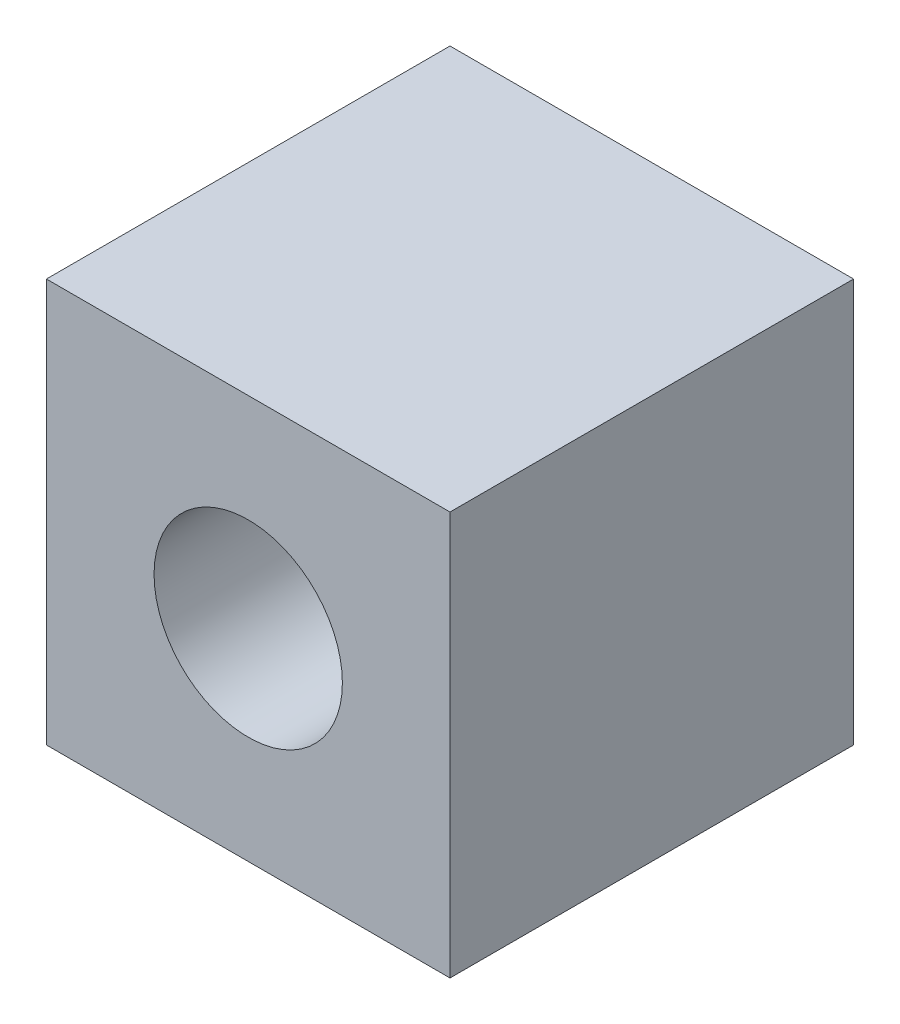
ISO-10303-21;
HEADER;
FILE_DESCRIPTION(('STEP AP214'),'2;1');
FILE_NAME('part.step','',(''),(''),'','','');
FILE_SCHEMA(('AUTOMOTIVE_DESIGN { 1 0 10303 214 1 1 1 1 }'));
ENDSEC;
DATA;
#1=APPLICATION_CONTEXT('core data for automotive mechanical design processes');
#2=APPLICATION_PROTOCOL_DEFINITION('international standard','automotive_design',2000,#1);
#3=PRODUCT_CONTEXT('',#1,'mechanical');
#4=PRODUCT('Part','Part','',(#3));
#5=PRODUCT_RELATED_PRODUCT_CATEGORY('part','',(#4));
#6=PRODUCT_DEFINITION_FORMATION('','',#4);
#7=PRODUCT_DEFINITION_CONTEXT('part definition',#1,'design');
#8=PRODUCT_DEFINITION('design','',#6,#7);
#9=PRODUCT_DEFINITION_SHAPE('','',#8);
#10=(LENGTH_UNIT() NAMED_UNIT(*) SI_UNIT(.MILLI.,.METRE.));
#11=(NAMED_UNIT(*) PLANE_ANGLE_UNIT() SI_UNIT($,.RADIAN.));
#12=(NAMED_UNIT(*) SI_UNIT($,.STERADIAN.) SOLID_ANGLE_UNIT());
#13=UNCERTAINTY_MEASURE_WITH_UNIT(LENGTH_MEASURE(1.E-05),#10,'distance_accuracy_value','');
#14=(GEOMETRIC_REPRESENTATION_CONTEXT(3) GLOBAL_UNCERTAINTY_ASSIGNED_CONTEXT((#13)) GLOBAL_UNIT_ASSIGNED_CONTEXT((#10,
#11,#12)) REPRESENTATION_CONTEXT('',''));
#15=CARTESIAN_POINT('',(0.,0.,0.));
#16=DIRECTION('',(0.,0.,1.));
#17=DIRECTION('',(1.,0.,0.));
#18=AXIS2_PLACEMENT_3D('',#15,#16,#17);
#19=CARTESIAN_POINT('',(-2.77884564684904,2.89301310043668,6.));
#20=DIRECTION('',(1.,0.,0.));
#21=DIRECTION('',(0.,1.,0.));
#22=AXIS2_PLACEMENT_3D('',#19,#20,#21);
#23=PLANE('',#22);
#24=DIRECTION('',(0.,-1.,0.));
#25=VECTOR('',#24,1.);
#26=CARTESIAN_POINT('',(-2.77884564684904,2.89301310043668,0.));
#27=LINE('',#26,#25);
#28=CARTESIAN_POINT('',(-2.77884564684904,2.89301310043668,0.));
#29=VERTEX_POINT('',#28);
#30=CARTESIAN_POINT('',(-2.77884564684904,-3.10698689956332,0.));
#31=VERTEX_POINT('',#30);
#32=EDGE_CURVE('E96',#29,#31,#27,.T.);
#33=ORIENTED_EDGE('',*,*,#32,.T.);
#34=DIRECTION('',(0.,0.,-1.));
#35=VECTOR('',#34,1.);
#36=CARTESIAN_POINT('',(-2.77884564684904,-3.10698689956332,6.));
#37=LINE('',#36,#35);
#38=CARTESIAN_POINT('',(-2.77884564684904,-3.10698689956332,6.));
#39=VERTEX_POINT('',#38);
#40=EDGE_CURVE('E11',#39,#31,#37,.T.);
#41=ORIENTED_EDGE('',*,*,#40,.F.);
#42=DIRECTION('',(0.,-1.,0.));
#43=VECTOR('',#42,1.);
#44=CARTESIAN_POINT('',(-2.77884564684904,2.89301310043668,6.));
#45=LINE('',#44,#43);
#46=CARTESIAN_POINT('',(-2.77884564684904,2.89301310043668,6.));
#47=VERTEX_POINT('',#46);
#48=EDGE_CURVE('E84',#47,#39,#45,.T.);
#49=ORIENTED_EDGE('',*,*,#48,.F.);
#50=DIRECTION('',(0.,0.,-1.));
#51=VECTOR('',#50,1.);
#52=CARTESIAN_POINT('',(-2.77884564684904,2.89301310043668,6.));
#53=LINE('',#52,#51);
#54=EDGE_CURVE('E92',#47,#29,#53,.T.);
#55=ORIENTED_EDGE('',*,*,#54,.T.);
#56=EDGE_LOOP('',(#33,#41,#49,#55));
#57=FACE_BOUND('',#56,.T.);
#58=ADVANCED_FACE('F33',(#57),#23,.F.);
#59=CARTESIAN_POINT('',(-2.77884564684904,-3.10698689956332,6.));
#60=DIRECTION('',(0.,1.,0.));
#61=DIRECTION('',(0.,0.,1.));
#62=AXIS2_PLACEMENT_3D('',#59,#60,#61);
#63=PLANE('',#62);
#64=DIRECTION('',(1.,0.,0.));
#65=VECTOR('',#64,1.);
#66=CARTESIAN_POINT('',(-2.77884564684904,-3.10698689956332,0.));
#67=LINE('',#66,#65);
#68=CARTESIAN_POINT('',(3.22115435315096,-3.10698689956332,0.));
#69=VERTEX_POINT('',#68);
#70=EDGE_CURVE('E88',#31,#69,#67,.T.);
#71=ORIENTED_EDGE('',*,*,#70,.T.);
#72=DIRECTION('',(0.,0.,-1.));
#73=VECTOR('',#72,1.);
#74=CARTESIAN_POINT('',(3.22115435315096,-3.10698689956332,6.));
#75=LINE('',#74,#73);
#76=CARTESIAN_POINT('',(3.22115435315096,-3.10698689956332,6.));
#77=VERTEX_POINT('',#76);
#78=EDGE_CURVE('E41',#77,#69,#75,.T.);
#79=ORIENTED_EDGE('',*,*,#78,.F.);
#80=DIRECTION('',(1.,0.,0.));
#81=VECTOR('',#80,1.);
#82=CARTESIAN_POINT('',(-2.77884564684904,-3.10698689956332,6.));
#83=LINE('',#82,#81);
#84=EDGE_CURVE('E79',#39,#77,#83,.T.);
#85=ORIENTED_EDGE('',*,*,#84,.F.);
#86=ORIENTED_EDGE('',*,*,#40,.T.);
#87=EDGE_LOOP('',(#71,#79,#85,#86));
#88=FACE_BOUND('',#87,.T.);
#89=ADVANCED_FACE('F87',(#88),#63,.F.);
#90=CARTESIAN_POINT('',(3.22115435315096,2.89301310043668,6.));
#91=DIRECTION('',(-1.,0.,0.));
#92=DIRECTION('',(0.,-1.,0.));
#93=AXIS2_PLACEMENT_3D('',#90,#91,#92);
#94=PLANE('',#93);
#95=DIRECTION('',(0.,1.,0.));
#96=VECTOR('',#95,1.);
#97=CARTESIAN_POINT('',(3.22115435315096,2.89301310043668,0.));
#98=LINE('',#97,#96);
#99=CARTESIAN_POINT('',(3.22115435315096,2.89301310043668,0.));
#100=VERTEX_POINT('',#99);
#101=EDGE_CURVE('E66',#69,#100,#98,.T.);
#102=ORIENTED_EDGE('',*,*,#101,.T.);
#103=DIRECTION('',(0.,0.,-1.));
#104=VECTOR('',#103,1.);
#105=CARTESIAN_POINT('',(3.22115435315096,2.89301310043668,6.));
#106=LINE('',#105,#104);
#107=CARTESIAN_POINT('',(3.22115435315096,2.89301310043668,6.));
#108=VERTEX_POINT('',#107);
#109=EDGE_CURVE('E89',#108,#100,#106,.T.);
#110=ORIENTED_EDGE('',*,*,#109,.F.);
#111=DIRECTION('',(0.,1.,0.));
#112=VECTOR('',#111,1.);
#113=CARTESIAN_POINT('',(3.22115435315096,2.89301310043668,6.));
#114=LINE('',#113,#112);
#115=EDGE_CURVE('E82',#77,#108,#114,.T.);
#116=ORIENTED_EDGE('',*,*,#115,.F.);
#117=ORIENTED_EDGE('',*,*,#78,.T.);
#118=EDGE_LOOP('',(#102,#110,#116,#117));
#119=FACE_BOUND('',#118,.T.);
#120=ADVANCED_FACE('F90',(#119),#94,.F.);
#121=CARTESIAN_POINT('',(-2.77884564684904,2.89301310043668,6.));
#122=DIRECTION('',(0.,-1.,0.));
#123=DIRECTION('',(0.,0.,-1.));
#124=AXIS2_PLACEMENT_3D('',#121,#122,#123);
#125=PLANE('',#124);
#126=DIRECTION('',(-1.,0.,0.));
#127=VECTOR('',#126,1.);
#128=CARTESIAN_POINT('',(-2.77884564684904,2.89301310043668,0.));
#129=LINE('',#128,#127);
#130=EDGE_CURVE('E72',#100,#29,#129,.T.);
#131=ORIENTED_EDGE('',*,*,#130,.T.);
#132=ORIENTED_EDGE('',*,*,#54,.F.);
#133=DIRECTION('',(-1.,0.,0.));
#134=VECTOR('',#133,1.);
#135=CARTESIAN_POINT('',(-2.77884564684904,2.89301310043668,6.));
#136=LINE('',#135,#134);
#137=EDGE_CURVE('E49',#108,#47,#136,.T.);
#138=ORIENTED_EDGE('',*,*,#137,.F.);
#139=ORIENTED_EDGE('',*,*,#109,.T.);
#140=EDGE_LOOP('',(#131,#132,#138,#139));
#141=FACE_BOUND('',#140,.T.);
#142=ADVANCED_FACE('F104',(#141),#125,.F.);
#143=CARTESIAN_POINT('',(0.,0.,6.));
#144=DIRECTION('',(0.,0.,1.));
#145=DIRECTION('',(1.,0.,0.));
#146=AXIS2_PLACEMENT_3D('',#143,#144,#145);
#147=PLANE('',#146);
#148=CARTESIAN_POINT('',(0.221154353150962,-0.106986899563318,6.));
#149=DIRECTION('',(0.,0.,1.));
#150=DIRECTION('',(1.,0.,0.));
#151=AXIS2_PLACEMENT_3D('',#148,#149,#150);
#152=CIRCLE('',#151,1.4);
#153=CARTESIAN_POINT('',(1.62115435315096,-0.106986899563318,6.));
#154=VERTEX_POINT('',#153);
#155=EDGE_CURVE('E110',#154,#154,#152,.T.);
#156=ORIENTED_EDGE('',*,*,#155,.F.);
#157=EDGE_LOOP('',(#156));
#158=FACE_BOUND('',#157,.T.);
#159=ORIENTED_EDGE('',*,*,#48,.T.);
#160=ORIENTED_EDGE('',*,*,#84,.T.);
#161=ORIENTED_EDGE('',*,*,#115,.T.);
#162=ORIENTED_EDGE('',*,*,#137,.T.);
#163=EDGE_LOOP('',(#159,#160,#161,#162));
#164=FACE_BOUND('',#163,.T.);
#165=ADVANCED_FACE('F80',(#158,#164),#147,.T.);
#166=CARTESIAN_POINT('',(0.,0.,0.));
#167=DIRECTION('',(0.,0.,1.));
#168=DIRECTION('',(1.,0.,0.));
#169=AXIS2_PLACEMENT_3D('',#166,#167,#168);
#170=PLANE('',#169);
#171=CARTESIAN_POINT('',(0.221154353150962,-0.106986899563318,0.));
#172=DIRECTION('',(0.,0.,1.));
#173=DIRECTION('',(1.,0.,0.));
#174=AXIS2_PLACEMENT_3D('',#171,#172,#173);
#175=CIRCLE('',#174,1.4);
#176=CARTESIAN_POINT('',(1.62115435315096,-0.106986899563318,0.));
#177=VERTEX_POINT('',#176);
#178=EDGE_CURVE('E99',#177,#177,#175,.T.);
#179=ORIENTED_EDGE('',*,*,#178,.T.);
#180=EDGE_LOOP('',(#179));
#181=FACE_BOUND('',#180,.T.);
#182=ORIENTED_EDGE('',*,*,#32,.F.);
#183=ORIENTED_EDGE('',*,*,#130,.F.);
#184=ORIENTED_EDGE('',*,*,#101,.F.);
#185=ORIENTED_EDGE('',*,*,#70,.F.);
#186=EDGE_LOOP('',(#182,#183,#184,#185));
#187=FACE_BOUND('',#186,.T.);
#188=ADVANCED_FACE('F107',(#181,#187),#170,.F.);
#189=CARTESIAN_POINT('',(0.221154353150962,-0.106986899563318,0.));
#190=DIRECTION('',(0.,0.,1.));
#191=DIRECTION('',(1.,0.,0.));
#192=AXIS2_PLACEMENT_3D('',#189,#190,#191);
#193=CYLINDRICAL_SURFACE('',#192,1.4);
#194=ORIENTED_EDGE('',*,*,#178,.F.);
#195=EDGE_LOOP('',(#194));
#196=FACE_BOUND('',#195,.T.);
#197=ORIENTED_EDGE('',*,*,#155,.T.);
#198=EDGE_LOOP('',(#197));
#199=FACE_BOUND('',#198,.T.);
#200=ADVANCED_FACE('F117',(#196,#199),#193,.F.);
#201=CLOSED_SHELL('',(#58,#89,#120,#142,#165,#188,#200));
#202=MANIFOLD_SOLID_BREP('B2',#201);
#203=ADVANCED_BREP_SHAPE_REPRESENTATION('',(#18,#202),#14);
#204=SHAPE_DEFINITION_REPRESENTATION(#9,#203);
ENDSEC;
END-ISO-10303-21;
